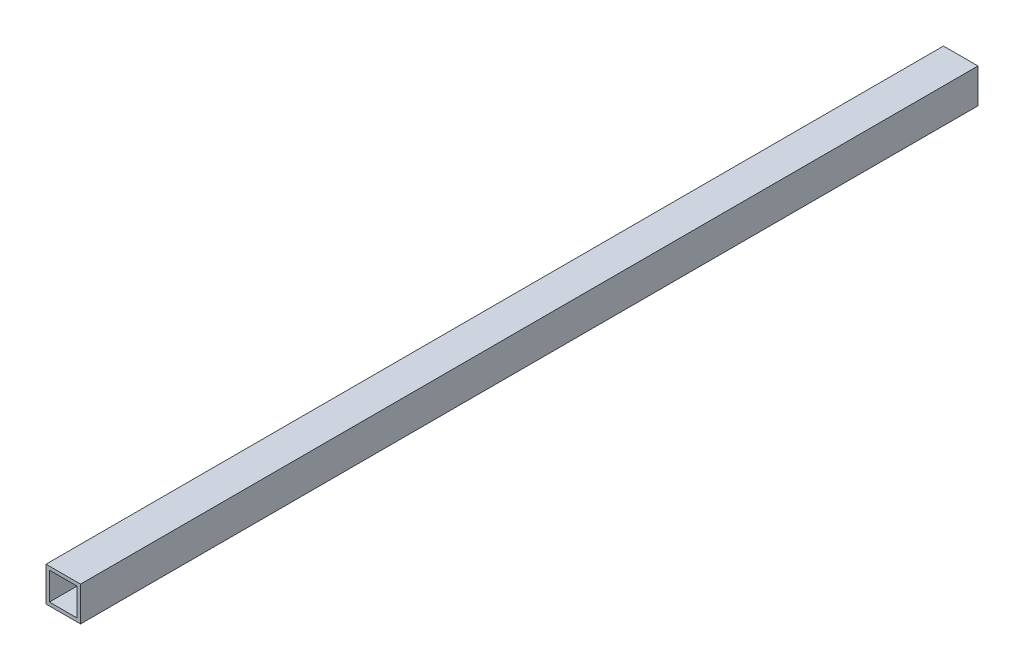
ISO-10303-21;
HEADER;
FILE_DESCRIPTION(('STEP AP214'),'2;1');
FILE_NAME('part.step','',(''),(''),'','','');
FILE_SCHEMA(('AUTOMOTIVE_DESIGN { 1 0 10303 214 1 1 1 1 }'));
ENDSEC;
DATA;
#1=APPLICATION_CONTEXT('core data for automotive mechanical design processes');
#2=APPLICATION_PROTOCOL_DEFINITION('international standard','automotive_design',2000,#1);
#3=PRODUCT_CONTEXT('',#1,'mechanical');
#4=PRODUCT('Part','Part','',(#3));
#5=PRODUCT_RELATED_PRODUCT_CATEGORY('part','',(#4));
#6=PRODUCT_DEFINITION_FORMATION('','',#4);
#7=PRODUCT_DEFINITION_CONTEXT('part definition',#1,'design');
#8=PRODUCT_DEFINITION('design','',#6,#7);
#9=PRODUCT_DEFINITION_SHAPE('','',#8);
#10=(LENGTH_UNIT() NAMED_UNIT(*) SI_UNIT(.MILLI.,.METRE.));
#11=(NAMED_UNIT(*) PLANE_ANGLE_UNIT() SI_UNIT($,.RADIAN.));
#12=(NAMED_UNIT(*) SI_UNIT($,.STERADIAN.) SOLID_ANGLE_UNIT());
#13=UNCERTAINTY_MEASURE_WITH_UNIT(LENGTH_MEASURE(1.E-05),#10,'distance_accuracy_value','');
#14=(GEOMETRIC_REPRESENTATION_CONTEXT(3) GLOBAL_UNCERTAINTY_ASSIGNED_CONTEXT((#13)) GLOBAL_UNIT_ASSIGNED_CONTEXT((#10,
#11,#12)) REPRESENTATION_CONTEXT('',''));
#15=CARTESIAN_POINT('',(0.,0.,0.));
#16=DIRECTION('',(0.,0.,1.));
#17=DIRECTION('',(1.,0.,0.));
#18=AXIS2_PLACEMENT_3D('',#15,#16,#17);
#19=CARTESIAN_POINT('',(-20.,20.,520.));
#20=DIRECTION('',(1.,0.,0.));
#21=DIRECTION('',(0.,0.,-1.));
#22=AXIS2_PLACEMENT_3D('',#19,#20,#21);
#23=PLANE('',#22);
#24=DIRECTION('',(0.,0.,-1.));
#25=VECTOR('',#24,1.);
#26=CARTESIAN_POINT('',(-20.,-20.,520.));
#27=LINE('',#26,#25);
#28=CARTESIAN_POINT('',(-20.,-20.,520.));
#29=VERTEX_POINT('',#28);
#30=CARTESIAN_POINT('',(-20.,-20.,-520.));
#31=VERTEX_POINT('',#30);
#32=EDGE_CURVE('E98',#29,#31,#27,.T.);
#33=ORIENTED_EDGE('',*,*,#32,.F.);
#34=DIRECTION('',(0.,-1.,0.));
#35=VECTOR('',#34,1.);
#36=CARTESIAN_POINT('',(-20.,20.,520.));
#37=LINE('',#36,#35);
#38=CARTESIAN_POINT('',(-20.,20.,520.));
#39=VERTEX_POINT('',#38);
#40=EDGE_CURVE('E87',#39,#29,#37,.T.);
#41=ORIENTED_EDGE('',*,*,#40,.F.);
#42=DIRECTION('',(0.,0.,-1.));
#43=VECTOR('',#42,1.);
#44=CARTESIAN_POINT('',(-20.,20.,520.));
#45=LINE('',#44,#43);
#46=CARTESIAN_POINT('',(-20.,20.,-520.));
#47=VERTEX_POINT('',#46);
#48=EDGE_CURVE('E103',#39,#47,#45,.T.);
#49=ORIENTED_EDGE('',*,*,#48,.T.);
#50=DIRECTION('',(0.,-1.,0.));
#51=VECTOR('',#50,1.);
#52=CARTESIAN_POINT('',(-20.,20.,-520.));
#53=LINE('',#52,#51);
#54=EDGE_CURVE('E99',#47,#31,#53,.T.);
#55=ORIENTED_EDGE('',*,*,#54,.T.);
#56=EDGE_LOOP('',(#33,#41,#49,#55));
#57=FACE_BOUND('',#56,.T.);
#58=ADVANCED_FACE('F35',(#57),#23,.F.);
#59=CARTESIAN_POINT('',(-20.,-20.,520.));
#60=DIRECTION('',(0.,1.,0.));
#61=DIRECTION('',(0.,0.,1.));
#62=AXIS2_PLACEMENT_3D('',#59,#60,#61);
#63=PLANE('',#62);
#64=DIRECTION('',(0.,0.,-1.));
#65=VECTOR('',#64,1.);
#66=CARTESIAN_POINT('',(20.,-20.,520.));
#67=LINE('',#66,#65);
#68=CARTESIAN_POINT('',(20.,-20.,520.));
#69=VERTEX_POINT('',#68);
#70=CARTESIAN_POINT('',(20.,-20.,-520.));
#71=VERTEX_POINT('',#70);
#72=EDGE_CURVE('E102',#69,#71,#67,.T.);
#73=ORIENTED_EDGE('',*,*,#72,.F.);
#74=DIRECTION('',(1.,0.,0.));
#75=VECTOR('',#74,1.);
#76=CARTESIAN_POINT('',(-20.,-20.,520.));
#77=LINE('',#76,#75);
#78=EDGE_CURVE('E84',#29,#69,#77,.T.);
#79=ORIENTED_EDGE('',*,*,#78,.F.);
#80=ORIENTED_EDGE('',*,*,#32,.T.);
#81=DIRECTION('',(1.,0.,0.));
#82=VECTOR('',#81,1.);
#83=CARTESIAN_POINT('',(-20.,-20.,-520.));
#84=LINE('',#83,#82);
#85=EDGE_CURVE('E125',#31,#71,#84,.T.);
#86=ORIENTED_EDGE('',*,*,#85,.T.);
#87=EDGE_LOOP('',(#73,#79,#80,#86));
#88=FACE_BOUND('',#87,.T.);
#89=ADVANCED_FACE('F105',(#88),#63,.F.);
#90=CARTESIAN_POINT('',(20.,20.,520.));
#91=DIRECTION('',(-1.,0.,0.));
#92=DIRECTION('',(0.,0.,1.));
#93=AXIS2_PLACEMENT_3D('',#90,#91,#92);
#94=PLANE('',#93);
#95=DIRECTION('',(0.,0.,-1.));
#96=VECTOR('',#95,1.);
#97=CARTESIAN_POINT('',(20.,20.,520.));
#98=LINE('',#97,#96);
#99=CARTESIAN_POINT('',(20.,20.,520.));
#100=VERTEX_POINT('',#99);
#101=CARTESIAN_POINT('',(20.,20.,-520.));
#102=VERTEX_POINT('',#101);
#103=EDGE_CURVE('E39',#100,#102,#98,.T.);
#104=ORIENTED_EDGE('',*,*,#103,.F.);
#105=DIRECTION('',(0.,1.,0.));
#106=VECTOR('',#105,1.);
#107=CARTESIAN_POINT('',(20.,20.,520.));
#108=LINE('',#107,#106);
#109=EDGE_CURVE('E108',#69,#100,#108,.T.);
#110=ORIENTED_EDGE('',*,*,#109,.F.);
#111=ORIENTED_EDGE('',*,*,#72,.T.);
#112=DIRECTION('',(0.,1.,0.));
#113=VECTOR('',#112,1.);
#114=CARTESIAN_POINT('',(20.,20.,-520.));
#115=LINE('',#114,#113);
#116=EDGE_CURVE('E112',#71,#102,#115,.T.);
#117=ORIENTED_EDGE('',*,*,#116,.T.);
#118=EDGE_LOOP('',(#104,#110,#111,#117));
#119=FACE_BOUND('',#118,.T.);
#120=ADVANCED_FACE('F123',(#119),#94,.F.);
#121=CARTESIAN_POINT('',(-20.,20.,520.));
#122=DIRECTION('',(0.,-1.,0.));
#123=DIRECTION('',(0.,0.,-1.));
#124=AXIS2_PLACEMENT_3D('',#121,#122,#123);
#125=PLANE('',#124);
#126=DIRECTION('',(-1.,0.,0.));
#127=VECTOR('',#126,1.);
#128=CARTESIAN_POINT('',(-20.,20.,-520.));
#129=LINE('',#128,#127);
#130=EDGE_CURVE('E122',#102,#47,#129,.T.);
#131=ORIENTED_EDGE('',*,*,#130,.T.);
#132=ORIENTED_EDGE('',*,*,#48,.F.);
#133=DIRECTION('',(-1.,0.,0.));
#134=VECTOR('',#133,1.);
#135=CARTESIAN_POINT('',(-20.,20.,520.));
#136=LINE('',#135,#134);
#137=EDGE_CURVE('E91',#100,#39,#136,.T.);
#138=ORIENTED_EDGE('',*,*,#137,.F.);
#139=ORIENTED_EDGE('',*,*,#103,.T.);
#140=EDGE_LOOP('',(#131,#132,#138,#139));
#141=FACE_BOUND('',#140,.T.);
#142=ADVANCED_FACE('F37',(#141),#125,.F.);
#143=CARTESIAN_POINT('',(0.,0.,520.));
#144=DIRECTION('',(0.,0.,1.));
#145=DIRECTION('',(1.,0.,0.));
#146=AXIS2_PLACEMENT_3D('',#143,#144,#145);
#147=PLANE('',#146);
#148=DIRECTION('',(0.,-1.,0.));
#149=VECTOR('',#148,1.);
#150=CARTESIAN_POINT('',(-16.,16.,520.));
#151=LINE('',#150,#149);
#152=CARTESIAN_POINT('',(-16.,-16.,520.));
#153=VERTEX_POINT('',#152);
#154=CARTESIAN_POINT('',(-16.,16.,520.));
#155=VERTEX_POINT('',#154);
#156=EDGE_CURVE('E130',#153,#155,#151,.F.);
#157=ORIENTED_EDGE('',*,*,#156,.T.);
#158=DIRECTION('',(-1.,0.,0.));
#159=VECTOR('',#158,1.);
#160=CARTESIAN_POINT('',(-16.,16.,520.));
#161=LINE('',#160,#159);
#162=CARTESIAN_POINT('',(16.,16.,520.));
#163=VERTEX_POINT('',#162);
#164=EDGE_CURVE('E126',#155,#163,#161,.F.);
#165=ORIENTED_EDGE('',*,*,#164,.T.);
#166=DIRECTION('',(0.,1.,0.));
#167=VECTOR('',#166,1.);
#168=CARTESIAN_POINT('',(16.,16.,520.));
#169=LINE('',#168,#167);
#170=CARTESIAN_POINT('',(16.,-16.,520.));
#171=VERTEX_POINT('',#170);
#172=EDGE_CURVE('E144',#163,#171,#169,.F.);
#173=ORIENTED_EDGE('',*,*,#172,.T.);
#174=DIRECTION('',(1.,0.,0.));
#175=VECTOR('',#174,1.);
#176=CARTESIAN_POINT('',(-16.,-16.,520.));
#177=LINE('',#176,#175);
#178=EDGE_CURVE('E134',#171,#153,#177,.F.);
#179=ORIENTED_EDGE('',*,*,#178,.T.);
#180=EDGE_LOOP('',(#157,#165,#173,#179));
#181=FACE_BOUND('',#180,.T.);
#182=ORIENTED_EDGE('',*,*,#40,.T.);
#183=ORIENTED_EDGE('',*,*,#78,.T.);
#184=ORIENTED_EDGE('',*,*,#109,.T.);
#185=ORIENTED_EDGE('',*,*,#137,.T.);
#186=EDGE_LOOP('',(#182,#183,#184,#185));
#187=FACE_BOUND('',#186,.T.);
#188=ADVANCED_FACE('F89',(#181,#187),#147,.T.);
#189=CARTESIAN_POINT('',(0.,0.,-520.));
#190=DIRECTION('',(0.,0.,1.));
#191=DIRECTION('',(1.,0.,0.));
#192=AXIS2_PLACEMENT_3D('',#189,#190,#191);
#193=PLANE('',#192);
#194=DIRECTION('',(0.,-1.,0.));
#195=VECTOR('',#194,1.);
#196=CARTESIAN_POINT('',(-16.,16.,-520.));
#197=LINE('',#196,#195);
#198=CARTESIAN_POINT('',(-16.,-16.,-520.));
#199=VERTEX_POINT('',#198);
#200=CARTESIAN_POINT('',(-16.,16.,-520.));
#201=VERTEX_POINT('',#200);
#202=EDGE_CURVE('E11',#199,#201,#197,.F.);
#203=ORIENTED_EDGE('',*,*,#202,.F.);
#204=DIRECTION('',(1.,0.,0.));
#205=VECTOR('',#204,1.);
#206=CARTESIAN_POINT('',(-16.,-16.,-520.));
#207=LINE('',#206,#205);
#208=CARTESIAN_POINT('',(16.,-16.,-520.));
#209=VERTEX_POINT('',#208);
#210=EDGE_CURVE('E45',#209,#199,#207,.F.);
#211=ORIENTED_EDGE('',*,*,#210,.F.);
#212=DIRECTION('',(0.,1.,0.));
#213=VECTOR('',#212,1.);
#214=CARTESIAN_POINT('',(16.,16.,-520.));
#215=LINE('',#214,#213);
#216=CARTESIAN_POINT('',(16.,16.,-520.));
#217=VERTEX_POINT('',#216);
#218=EDGE_CURVE('E141',#217,#209,#215,.F.);
#219=ORIENTED_EDGE('',*,*,#218,.F.);
#220=DIRECTION('',(-1.,0.,0.));
#221=VECTOR('',#220,1.);
#222=CARTESIAN_POINT('',(-16.,16.,-520.));
#223=LINE('',#222,#221);
#224=EDGE_CURVE('E138',#201,#217,#223,.F.);
#225=ORIENTED_EDGE('',*,*,#224,.F.);
#226=EDGE_LOOP('',(#203,#211,#219,#225));
#227=FACE_BOUND('',#226,.T.);
#228=ORIENTED_EDGE('',*,*,#54,.F.);
#229=ORIENTED_EDGE('',*,*,#130,.F.);
#230=ORIENTED_EDGE('',*,*,#116,.F.);
#231=ORIENTED_EDGE('',*,*,#85,.F.);
#232=EDGE_LOOP('',(#228,#229,#230,#231));
#233=FACE_BOUND('',#232,.T.);
#234=ADVANCED_FACE('F191',(#227,#233),#193,.F.);
#235=CARTESIAN_POINT('',(-16.,16.,520.));
#236=DIRECTION('',(0.,1.,0.));
#237=DIRECTION('',(0.,0.,1.));
#238=AXIS2_PLACEMENT_3D('',#235,#236,#237);
#239=PLANE('',#238);
#240=DIRECTION('',(0.,0.,-1.));
#241=VECTOR('',#240,1.);
#242=CARTESIAN_POINT('',(16.,16.,520.));
#243=LINE('',#242,#241);
#244=EDGE_CURVE('E146',#163,#217,#243,.T.);
#245=ORIENTED_EDGE('',*,*,#244,.F.);
#246=ORIENTED_EDGE('',*,*,#164,.F.);
#247=DIRECTION('',(0.,0.,-1.));
#248=VECTOR('',#247,1.);
#249=CARTESIAN_POINT('',(-16.,16.,520.));
#250=LINE('',#249,#248);
#251=EDGE_CURVE('E133',#155,#201,#250,.T.);
#252=ORIENTED_EDGE('',*,*,#251,.T.);
#253=ORIENTED_EDGE('',*,*,#224,.T.);
#254=EDGE_LOOP('',(#245,#246,#252,#253));
#255=FACE_BOUND('',#254,.T.);
#256=ADVANCED_FACE('F168',(#255),#239,.F.);
#257=CARTESIAN_POINT('',(16.,16.,520.));
#258=DIRECTION('',(1.,0.,0.));
#259=DIRECTION('',(0.,0.,-1.));
#260=AXIS2_PLACEMENT_3D('',#257,#258,#259);
#261=PLANE('',#260);
#262=DIRECTION('',(0.,0.,-1.));
#263=VECTOR('',#262,1.);
#264=CARTESIAN_POINT('',(16.,-16.,520.));
#265=LINE('',#264,#263);
#266=EDGE_CURVE('E139',#171,#209,#265,.T.);
#267=ORIENTED_EDGE('',*,*,#266,.F.);
#268=ORIENTED_EDGE('',*,*,#172,.F.);
#269=ORIENTED_EDGE('',*,*,#244,.T.);
#270=ORIENTED_EDGE('',*,*,#218,.T.);
#271=EDGE_LOOP('',(#267,#268,#269,#270));
#272=FACE_BOUND('',#271,.T.);
#273=ADVANCED_FACE('F172',(#272),#261,.F.);
#274=CARTESIAN_POINT('',(-16.,-16.,520.));
#275=DIRECTION('',(0.,-1.,0.));
#276=DIRECTION('',(0.,0.,-1.));
#277=AXIS2_PLACEMENT_3D('',#274,#275,#276);
#278=PLANE('',#277);
#279=DIRECTION('',(0.,0.,-1.));
#280=VECTOR('',#279,1.);
#281=CARTESIAN_POINT('',(-16.,-16.,520.));
#282=LINE('',#281,#280);
#283=EDGE_CURVE('E135',#153,#199,#282,.T.);
#284=ORIENTED_EDGE('',*,*,#283,.F.);
#285=ORIENTED_EDGE('',*,*,#178,.F.);
#286=ORIENTED_EDGE('',*,*,#266,.T.);
#287=ORIENTED_EDGE('',*,*,#210,.T.);
#288=EDGE_LOOP('',(#284,#285,#286,#287));
#289=FACE_BOUND('',#288,.T.);
#290=ADVANCED_FACE('F180',(#289),#278,.F.);
#291=CARTESIAN_POINT('',(-16.,16.,520.));
#292=DIRECTION('',(-1.,0.,0.));
#293=DIRECTION('',(0.,0.,1.));
#294=AXIS2_PLACEMENT_3D('',#291,#292,#293);
#295=PLANE('',#294);
#296=ORIENTED_EDGE('',*,*,#202,.T.);
#297=ORIENTED_EDGE('',*,*,#251,.F.);
#298=ORIENTED_EDGE('',*,*,#156,.F.);
#299=ORIENTED_EDGE('',*,*,#283,.T.);
#300=EDGE_LOOP('',(#296,#297,#298,#299));
#301=FACE_BOUND('',#300,.T.);
#302=ADVANCED_FACE('F179',(#301),#295,.F.);
#303=CLOSED_SHELL('',(#58,#89,#120,#142,#188,#234,#256,#273,#290,#302));
#304=MANIFOLD_SOLID_BREP('B2',#303);
#305=ADVANCED_BREP_SHAPE_REPRESENTATION('',(#18,#304),#14);
#306=SHAPE_DEFINITION_REPRESENTATION(#9,#305);
ENDSEC;
END-ISO-10303-21;
